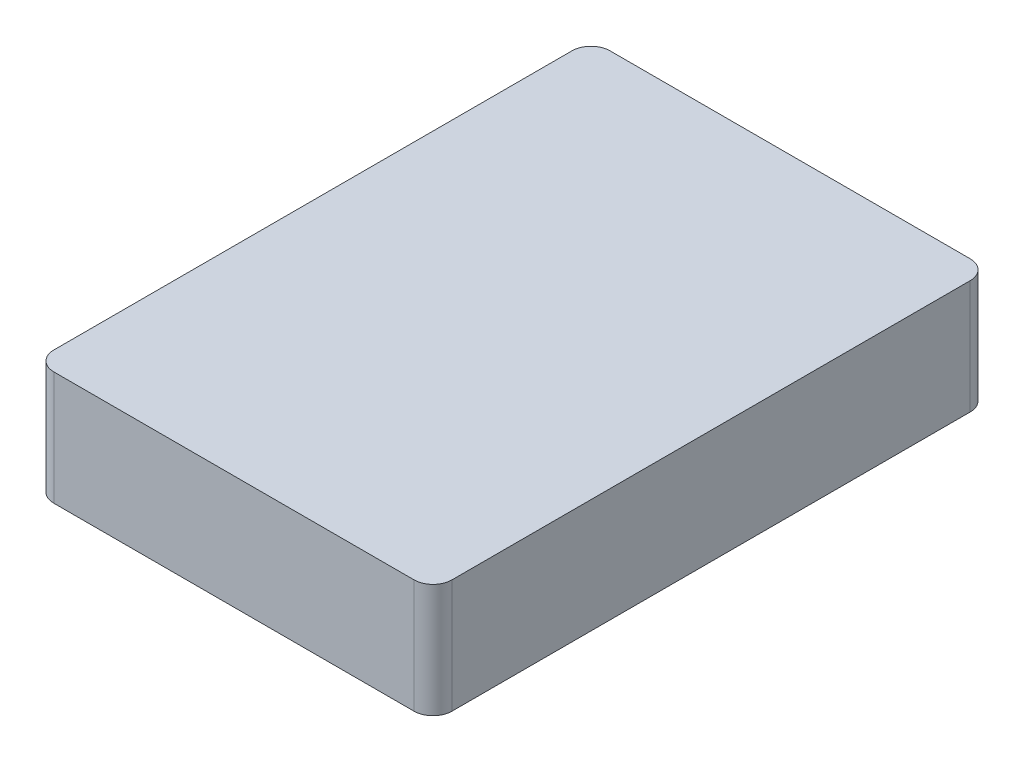
ISO-10303-21;
HEADER;
FILE_DESCRIPTION(('STEP AP214'),'2;1');
FILE_NAME('part.step','',(''),(''),'','','');
FILE_SCHEMA(('AUTOMOTIVE_DESIGN { 1 0 10303 214 1 1 1 1 }'));
ENDSEC;
DATA;
#1=APPLICATION_CONTEXT('core data for automotive mechanical design processes');
#2=APPLICATION_PROTOCOL_DEFINITION('international standard','automotive_design',2000,#1);
#3=PRODUCT_CONTEXT('',#1,'mechanical');
#4=PRODUCT('Part','Part','',(#3));
#5=PRODUCT_RELATED_PRODUCT_CATEGORY('part','',(#4));
#6=PRODUCT_DEFINITION_FORMATION('','',#4);
#7=PRODUCT_DEFINITION_CONTEXT('part definition',#1,'design');
#8=PRODUCT_DEFINITION('design','',#6,#7);
#9=PRODUCT_DEFINITION_SHAPE('','',#8);
#10=(LENGTH_UNIT() NAMED_UNIT(*) SI_UNIT(.MILLI.,.METRE.));
#11=(NAMED_UNIT(*) PLANE_ANGLE_UNIT() SI_UNIT($,.RADIAN.));
#12=(NAMED_UNIT(*) SI_UNIT($,.STERADIAN.) SOLID_ANGLE_UNIT());
#13=UNCERTAINTY_MEASURE_WITH_UNIT(LENGTH_MEASURE(1.E-05),#10,'distance_accuracy_value','');
#14=(GEOMETRIC_REPRESENTATION_CONTEXT(3) GLOBAL_UNCERTAINTY_ASSIGNED_CONTEXT((#13)) GLOBAL_UNIT_ASSIGNED_CONTEXT((#10,
#11,#12)) REPRESENTATION_CONTEXT('',''));
#15=CARTESIAN_POINT('',(0.,0.,0.));
#16=DIRECTION('',(0.,0.,1.));
#17=DIRECTION('',(1.,0.,0.));
#18=AXIS2_PLACEMENT_3D('',#15,#16,#17);
#19=CARTESIAN_POINT('',(-28.5,18.,41.));
#20=DIRECTION('',(0.,-1.,0.));
#21=DIRECTION('',(0.,0.,-1.));
#22=AXIS2_PLACEMENT_3D('',#19,#20,#21);
#23=CYLINDRICAL_SURFACE('',#22,3.);
#24=CARTESIAN_POINT('',(-28.5,0.,41.));
#25=DIRECTION('',(0.,1.,0.));
#26=DIRECTION('',(0.,0.,-1.));
#27=AXIS2_PLACEMENT_3D('',#24,#25,#26);
#28=CIRCLE('',#27,3.);
#29=CARTESIAN_POINT('',(-31.5,0.,41.));
#30=VERTEX_POINT('',#29);
#31=CARTESIAN_POINT('',(-28.5,0.,44.));
#32=VERTEX_POINT('',#31);
#33=EDGE_CURVE('E128',#30,#32,#28,.T.);
#34=ORIENTED_EDGE('',*,*,#33,.T.);
#35=DIRECTION('',(0.,-1.,0.));
#36=VECTOR('',#35,1.);
#37=CARTESIAN_POINT('',(-28.5,18.,44.));
#38=LINE('',#37,#36);
#39=CARTESIAN_POINT('',(-28.5,18.,44.));
#40=VERTEX_POINT('',#39);
#41=EDGE_CURVE('E11',#40,#32,#38,.T.);
#42=ORIENTED_EDGE('',*,*,#41,.F.);
#43=CARTESIAN_POINT('',(-28.5,18.,41.));
#44=DIRECTION('',(0.,1.,0.));
#45=DIRECTION('',(0.,0.,-1.));
#46=AXIS2_PLACEMENT_3D('',#43,#44,#45);
#47=CIRCLE('',#46,3.);
#48=CARTESIAN_POINT('',(-31.5,18.,41.));
#49=VERTEX_POINT('',#48);
#50=EDGE_CURVE('E142',#49,#40,#47,.T.);
#51=ORIENTED_EDGE('',*,*,#50,.F.);
#52=DIRECTION('',(0.,-1.,0.));
#53=VECTOR('',#52,1.);
#54=CARTESIAN_POINT('',(-31.5,18.,41.));
#55=LINE('',#54,#53);
#56=EDGE_CURVE('E124',#49,#30,#55,.T.);
#57=ORIENTED_EDGE('',*,*,#56,.T.);
#58=EDGE_LOOP('',(#34,#42,#51,#57));
#59=FACE_BOUND('',#58,.T.);
#60=ADVANCED_FACE('F32',(#59),#23,.T.);
#61=CARTESIAN_POINT('',(28.5,18.,44.));
#62=DIRECTION('',(0.,0.,-1.));
#63=DIRECTION('',(-1.,0.,0.));
#64=AXIS2_PLACEMENT_3D('',#61,#62,#63);
#65=PLANE('',#64);
#66=DIRECTION('',(1.,0.,0.));
#67=VECTOR('',#66,1.);
#68=CARTESIAN_POINT('',(28.5,0.,44.));
#69=LINE('',#68,#67);
#70=CARTESIAN_POINT('',(28.5,0.,44.));
#71=VERTEX_POINT('',#70);
#72=EDGE_CURVE('E131',#32,#71,#69,.T.);
#73=ORIENTED_EDGE('',*,*,#72,.T.);
#74=DIRECTION('',(0.,-1.,0.));
#75=VECTOR('',#74,1.);
#76=CARTESIAN_POINT('',(28.5,18.,44.));
#77=LINE('',#76,#75);
#78=CARTESIAN_POINT('',(28.5,18.,44.));
#79=VERTEX_POINT('',#78);
#80=EDGE_CURVE('E40',#79,#71,#77,.T.);
#81=ORIENTED_EDGE('',*,*,#80,.F.);
#82=DIRECTION('',(1.,0.,0.));
#83=VECTOR('',#82,1.);
#84=CARTESIAN_POINT('',(28.5,18.,44.));
#85=LINE('',#84,#83);
#86=EDGE_CURVE('E91',#40,#79,#85,.T.);
#87=ORIENTED_EDGE('',*,*,#86,.F.);
#88=ORIENTED_EDGE('',*,*,#41,.T.);
#89=EDGE_LOOP('',(#73,#81,#87,#88));
#90=FACE_BOUND('',#89,.T.);
#91=ADVANCED_FACE('F177',(#90),#65,.F.);
#92=CARTESIAN_POINT('',(28.5,18.,41.));
#93=DIRECTION('',(0.,-1.,0.));
#94=DIRECTION('',(0.,0.,-1.));
#95=AXIS2_PLACEMENT_3D('',#92,#93,#94);
#96=CYLINDRICAL_SURFACE('',#95,3.);
#97=CARTESIAN_POINT('',(28.5,0.,41.));
#98=DIRECTION('',(0.,1.,0.));
#99=DIRECTION('',(0.,0.,1.));
#100=AXIS2_PLACEMENT_3D('',#97,#98,#99);
#101=CIRCLE('',#100,3.);
#102=CARTESIAN_POINT('',(31.5,0.,41.));
#103=VERTEX_POINT('',#102);
#104=EDGE_CURVE('E133',#71,#103,#101,.T.);
#105=ORIENTED_EDGE('',*,*,#104,.T.);
#106=DIRECTION('',(0.,-1.,0.));
#107=VECTOR('',#106,1.);
#108=CARTESIAN_POINT('',(31.5,18.,41.));
#109=LINE('',#108,#107);
#110=CARTESIAN_POINT('',(31.5,18.,41.));
#111=VERTEX_POINT('',#110);
#112=EDGE_CURVE('E149',#111,#103,#109,.T.);
#113=ORIENTED_EDGE('',*,*,#112,.F.);
#114=CARTESIAN_POINT('',(28.5,18.,41.));
#115=DIRECTION('',(0.,1.,0.));
#116=DIRECTION('',(0.,0.,1.));
#117=AXIS2_PLACEMENT_3D('',#114,#115,#116);
#118=CIRCLE('',#117,3.);
#119=EDGE_CURVE('E157',#79,#111,#118,.T.);
#120=ORIENTED_EDGE('',*,*,#119,.F.);
#121=ORIENTED_EDGE('',*,*,#80,.T.);
#122=EDGE_LOOP('',(#105,#113,#120,#121));
#123=FACE_BOUND('',#122,.T.);
#124=ADVANCED_FACE('F155',(#123),#96,.T.);
#125=CARTESIAN_POINT('',(31.5,18.,41.));
#126=DIRECTION('',(-1.,0.,0.));
#127=DIRECTION('',(0.,0.,1.));
#128=AXIS2_PLACEMENT_3D('',#125,#126,#127);
#129=PLANE('',#128);
#130=DIRECTION('',(0.,0.,-1.));
#131=VECTOR('',#130,1.);
#132=CARTESIAN_POINT('',(31.5,0.,41.));
#133=LINE('',#132,#131);
#134=CARTESIAN_POINT('',(31.5,0.,-41.));
#135=VERTEX_POINT('',#134);
#136=EDGE_CURVE('E135',#103,#135,#133,.T.);
#137=ORIENTED_EDGE('',*,*,#136,.T.);
#138=DIRECTION('',(0.,-1.,0.));
#139=VECTOR('',#138,1.);
#140=CARTESIAN_POINT('',(31.5,18.,-41.));
#141=LINE('',#140,#139);
#142=CARTESIAN_POINT('',(31.5,18.,-41.));
#143=VERTEX_POINT('',#142);
#144=EDGE_CURVE('E146',#143,#135,#141,.T.);
#145=ORIENTED_EDGE('',*,*,#144,.F.);
#146=DIRECTION('',(0.,0.,-1.));
#147=VECTOR('',#146,1.);
#148=CARTESIAN_POINT('',(31.5,18.,41.));
#149=LINE('',#148,#147);
#150=EDGE_CURVE('E169',#111,#143,#149,.T.);
#151=ORIENTED_EDGE('',*,*,#150,.F.);
#152=ORIENTED_EDGE('',*,*,#112,.T.);
#153=EDGE_LOOP('',(#137,#145,#151,#152));
#154=FACE_BOUND('',#153,.T.);
#155=ADVANCED_FACE('F165',(#154),#129,.F.);
#156=CARTESIAN_POINT('',(28.5,18.,-41.));
#157=DIRECTION('',(0.,-1.,0.));
#158=DIRECTION('',(0.,0.,-1.));
#159=AXIS2_PLACEMENT_3D('',#156,#157,#158);
#160=CYLINDRICAL_SURFACE('',#159,3.);
#161=CARTESIAN_POINT('',(28.5,0.,-41.));
#162=DIRECTION('',(0.,1.,0.));
#163=DIRECTION('',(0.,0.,1.));
#164=AXIS2_PLACEMENT_3D('',#161,#162,#163);
#165=CIRCLE('',#164,3.);
#166=CARTESIAN_POINT('',(28.5,0.,-44.));
#167=VERTEX_POINT('',#166);
#168=EDGE_CURVE('E137',#135,#167,#165,.T.);
#169=ORIENTED_EDGE('',*,*,#168,.T.);
#170=DIRECTION('',(0.,-1.,0.));
#171=VECTOR('',#170,1.);
#172=CARTESIAN_POINT('',(28.5,18.,-44.));
#173=LINE('',#172,#171);
#174=CARTESIAN_POINT('',(28.5,18.,-44.));
#175=VERTEX_POINT('',#174);
#176=EDGE_CURVE('E119',#175,#167,#173,.T.);
#177=ORIENTED_EDGE('',*,*,#176,.F.);
#178=CARTESIAN_POINT('',(28.5,18.,-41.));
#179=DIRECTION('',(0.,1.,0.));
#180=DIRECTION('',(0.,0.,1.));
#181=AXIS2_PLACEMENT_3D('',#178,#179,#180);
#182=CIRCLE('',#181,3.);
#183=EDGE_CURVE('E110',#143,#175,#182,.T.);
#184=ORIENTED_EDGE('',*,*,#183,.F.);
#185=ORIENTED_EDGE('',*,*,#144,.T.);
#186=EDGE_LOOP('',(#169,#177,#184,#185));
#187=FACE_BOUND('',#186,.T.);
#188=ADVANCED_FACE('F168',(#187),#160,.T.);
#189=CARTESIAN_POINT('',(28.5,18.,-44.));
#190=DIRECTION('',(0.,0.,1.));
#191=DIRECTION('',(1.,0.,0.));
#192=AXIS2_PLACEMENT_3D('',#189,#190,#191);
#193=PLANE('',#192);
#194=DIRECTION('',(-1.,0.,0.));
#195=VECTOR('',#194,1.);
#196=CARTESIAN_POINT('',(28.5,0.,-44.));
#197=LINE('',#196,#195);
#198=CARTESIAN_POINT('',(-28.5,0.,-44.));
#199=VERTEX_POINT('',#198);
#200=EDGE_CURVE('E118',#167,#199,#197,.T.);
#201=ORIENTED_EDGE('',*,*,#200,.T.);
#202=DIRECTION('',(0.,-1.,0.));
#203=VECTOR('',#202,1.);
#204=CARTESIAN_POINT('',(-28.5,18.,-44.));
#205=LINE('',#204,#203);
#206=CARTESIAN_POINT('',(-28.5,18.,-44.));
#207=VERTEX_POINT('',#206);
#208=EDGE_CURVE('E115',#207,#199,#205,.T.);
#209=ORIENTED_EDGE('',*,*,#208,.F.);
#210=DIRECTION('',(-1.,0.,0.));
#211=VECTOR('',#210,1.);
#212=CARTESIAN_POINT('',(28.5,18.,-44.));
#213=LINE('',#212,#211);
#214=EDGE_CURVE('E104',#175,#207,#213,.T.);
#215=ORIENTED_EDGE('',*,*,#214,.F.);
#216=ORIENTED_EDGE('',*,*,#176,.T.);
#217=EDGE_LOOP('',(#201,#209,#215,#216));
#218=FACE_BOUND('',#217,.T.);
#219=ADVANCED_FACE('F116',(#218),#193,.F.);
#220=CARTESIAN_POINT('',(-28.5,18.,-41.));
#221=DIRECTION('',(0.,-1.,0.));
#222=DIRECTION('',(0.,0.,-1.));
#223=AXIS2_PLACEMENT_3D('',#220,#221,#222);
#224=CYLINDRICAL_SURFACE('',#223,3.);
#225=CARTESIAN_POINT('',(-28.5,0.,-41.));
#226=DIRECTION('',(0.,1.,0.));
#227=DIRECTION('',(0.,0.,1.));
#228=AXIS2_PLACEMENT_3D('',#225,#226,#227);
#229=CIRCLE('',#228,3.);
#230=CARTESIAN_POINT('',(-31.5,0.,-41.));
#231=VERTEX_POINT('',#230);
#232=EDGE_CURVE('E77',#199,#231,#229,.T.);
#233=ORIENTED_EDGE('',*,*,#232,.T.);
#234=DIRECTION('',(0.,-1.,0.));
#235=VECTOR('',#234,1.);
#236=CARTESIAN_POINT('',(-31.5,18.,-41.));
#237=LINE('',#236,#235);
#238=CARTESIAN_POINT('',(-31.5,18.,-41.));
#239=VERTEX_POINT('',#238);
#240=EDGE_CURVE('E120',#239,#231,#237,.T.);
#241=ORIENTED_EDGE('',*,*,#240,.F.);
#242=CARTESIAN_POINT('',(-28.5,18.,-41.));
#243=DIRECTION('',(0.,1.,0.));
#244=DIRECTION('',(0.,0.,1.));
#245=AXIS2_PLACEMENT_3D('',#242,#243,#244);
#246=CIRCLE('',#245,3.);
#247=EDGE_CURVE('E108',#207,#239,#246,.T.);
#248=ORIENTED_EDGE('',*,*,#247,.F.);
#249=ORIENTED_EDGE('',*,*,#208,.T.);
#250=EDGE_LOOP('',(#233,#241,#248,#249));
#251=FACE_BOUND('',#250,.T.);
#252=ADVANCED_FACE('F122',(#251),#224,.T.);
#253=CARTESIAN_POINT('',(-31.5,18.,41.));
#254=DIRECTION('',(1.,0.,0.));
#255=DIRECTION('',(0.,0.,-1.));
#256=AXIS2_PLACEMENT_3D('',#253,#254,#255);
#257=PLANE('',#256);
#258=DIRECTION('',(0.,0.,1.));
#259=VECTOR('',#258,1.);
#260=CARTESIAN_POINT('',(-31.5,0.,41.));
#261=LINE('',#260,#259);
#262=EDGE_CURVE('E83',#231,#30,#261,.T.);
#263=ORIENTED_EDGE('',*,*,#262,.T.);
#264=ORIENTED_EDGE('',*,*,#56,.F.);
#265=DIRECTION('',(0.,0.,1.));
#266=VECTOR('',#265,1.);
#267=CARTESIAN_POINT('',(-31.5,18.,41.));
#268=LINE('',#267,#266);
#269=EDGE_CURVE('E48',#239,#49,#268,.T.);
#270=ORIENTED_EDGE('',*,*,#269,.F.);
#271=ORIENTED_EDGE('',*,*,#240,.T.);
#272=EDGE_LOOP('',(#263,#264,#270,#271));
#273=FACE_BOUND('',#272,.T.);
#274=ADVANCED_FACE('F193',(#273),#257,.F.);
#275=CARTESIAN_POINT('',(-28.5,18.,41.));
#276=DIRECTION('',(0.,-1.,0.));
#277=DIRECTION('',(0.,0.,-1.));
#278=AXIS2_PLACEMENT_3D('',#275,#276,#277);
#279=PLANE('',#278);
#280=ORIENTED_EDGE('',*,*,#50,.T.);
#281=ORIENTED_EDGE('',*,*,#86,.T.);
#282=ORIENTED_EDGE('',*,*,#119,.T.);
#283=ORIENTED_EDGE('',*,*,#150,.T.);
#284=ORIENTED_EDGE('',*,*,#183,.T.);
#285=ORIENTED_EDGE('',*,*,#214,.T.);
#286=ORIENTED_EDGE('',*,*,#247,.T.);
#287=ORIENTED_EDGE('',*,*,#269,.T.);
#288=EDGE_LOOP('',(#280,#281,#282,#283,#284,#285,#286,#287));
#289=FACE_BOUND('',#288,.T.);
#290=ADVANCED_FACE('F106',(#289),#279,.F.);
#291=CARTESIAN_POINT('',(-28.5,0.,41.));
#292=DIRECTION('',(0.,-1.,0.));
#293=DIRECTION('',(0.,0.,-1.));
#294=AXIS2_PLACEMENT_3D('',#291,#292,#293);
#295=PLANE('',#294);
#296=ORIENTED_EDGE('',*,*,#33,.F.);
#297=ORIENTED_EDGE('',*,*,#262,.F.);
#298=ORIENTED_EDGE('',*,*,#232,.F.);
#299=ORIENTED_EDGE('',*,*,#200,.F.);
#300=ORIENTED_EDGE('',*,*,#168,.F.);
#301=ORIENTED_EDGE('',*,*,#136,.F.);
#302=ORIENTED_EDGE('',*,*,#104,.F.);
#303=ORIENTED_EDGE('',*,*,#72,.F.);
#304=EDGE_LOOP('',(#296,#297,#298,#299,#300,#301,#302,#303));
#305=FACE_BOUND('',#304,.T.);
#306=ADVANCED_FACE('F161',(#305),#295,.T.);
#307=CLOSED_SHELL('',(#60,#91,#124,#155,#188,#219,#252,#274,#290,#306));
#308=MANIFOLD_SOLID_BREP('B2',#307);
#309=ADVANCED_BREP_SHAPE_REPRESENTATION('',(#18,#308),#14);
#310=SHAPE_DEFINITION_REPRESENTATION(#9,#309);
ENDSEC;
END-ISO-10303-21;
